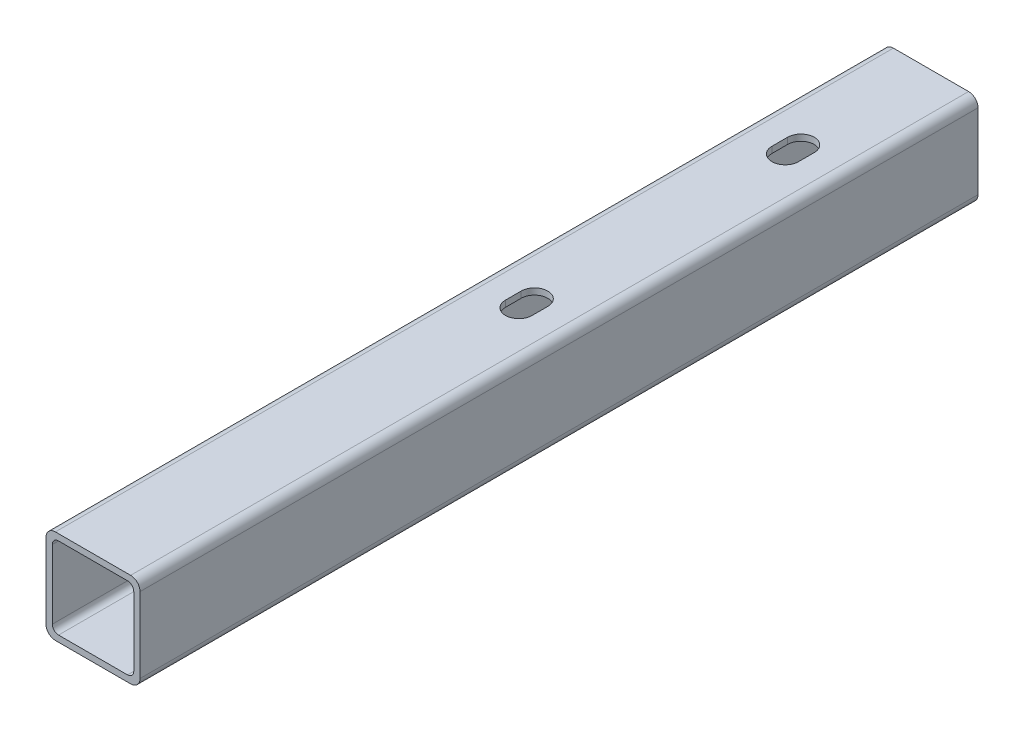
ISO-10303-21;
HEADER;
FILE_DESCRIPTION(('STEP AP214'),'2;1');
FILE_NAME('part.step','',(''),(''),'','','');
FILE_SCHEMA(('AUTOMOTIVE_DESIGN { 1 0 10303 214 1 1 1 1 }'));
ENDSEC;
DATA;
#1=APPLICATION_CONTEXT('core data for automotive mechanical design processes');
#2=APPLICATION_PROTOCOL_DEFINITION('international standard','automotive_design',2000,#1);
#3=PRODUCT_CONTEXT('',#1,'mechanical');
#4=PRODUCT('Part','Part','',(#3));
#5=PRODUCT_RELATED_PRODUCT_CATEGORY('part','',(#4));
#6=PRODUCT_DEFINITION_FORMATION('','',#4);
#7=PRODUCT_DEFINITION_CONTEXT('part definition',#1,'design');
#8=PRODUCT_DEFINITION('design','',#6,#7);
#9=PRODUCT_DEFINITION_SHAPE('','',#8);
#10=(LENGTH_UNIT() NAMED_UNIT(*) SI_UNIT(.MILLI.,.METRE.));
#11=(NAMED_UNIT(*) PLANE_ANGLE_UNIT() SI_UNIT($,.RADIAN.));
#12=(NAMED_UNIT(*) SI_UNIT($,.STERADIAN.) SOLID_ANGLE_UNIT());
#13=UNCERTAINTY_MEASURE_WITH_UNIT(LENGTH_MEASURE(1.E-05),#10,'distance_accuracy_value','');
#14=(GEOMETRIC_REPRESENTATION_CONTEXT(3) GLOBAL_UNCERTAINTY_ASSIGNED_CONTEXT((#13)) GLOBAL_UNIT_ASSIGNED_CONTEXT((#10,
#11,#12)) REPRESENTATION_CONTEXT('',''));
#15=CARTESIAN_POINT('',(0.,0.,0.));
#16=DIRECTION('',(0.,0.,1.));
#17=DIRECTION('',(1.,0.,0.));
#18=AXIS2_PLACEMENT_3D('',#15,#16,#17);
#19=CARTESIAN_POINT('',(3.00000000000003,-30.,-344.762716319083));
#20=DIRECTION('',(0.,-1.,0.));
#21=DIRECTION('',(1.,0.,0.));
#22=AXIS2_PLACEMENT_3D('',#19,#20,#21);
#23=PLANE('',#22);
#24=CARTESIAN_POINT('',(15.,-30.,-140.83630944789));
#25=DIRECTION('',(0.,-1.,0.));
#26=DIRECTION('',(1.,0.,0.));
#27=AXIS2_PLACEMENT_3D('',#24,#25,#26);
#28=CIRCLE('',#27,10.);
#29=CARTESIAN_POINT('',(4.99999999999999,-30.,-140.83630944789));
#30=VERTEX_POINT('',#29);
#31=CARTESIAN_POINT('',(25.,-30.,-140.83630944789));
#32=VERTEX_POINT('',#31);
#33=EDGE_CURVE('E49',#30,#32,#28,.T.);
#34=ORIENTED_EDGE('',*,*,#33,.F.);
#35=DIRECTION('',(0.,0.,-1.));
#36=VECTOR('',#35,1.);
#37=CARTESIAN_POINT('',(4.99999999999999,-30.,-140.83630944789));
#38=LINE('',#37,#36);
#39=CARTESIAN_POINT('',(4.99999999999999,-30.,-135.83630944789));
#40=VERTEX_POINT('',#39);
#41=EDGE_CURVE('E266',#40,#30,#38,.T.);
#42=ORIENTED_EDGE('',*,*,#41,.F.);
#43=CARTESIAN_POINT('',(15.,-30.,-135.83630944789));
#44=DIRECTION('',(0.,-1.,0.));
#45=DIRECTION('',(1.,0.,0.));
#46=AXIS2_PLACEMENT_3D('',#43,#44,#45);
#47=CIRCLE('',#46,10.);
#48=CARTESIAN_POINT('',(25.,-30.,-135.83630944789));
#49=VERTEX_POINT('',#48);
#50=EDGE_CURVE('E250',#49,#40,#47,.T.);
#51=ORIENTED_EDGE('',*,*,#50,.F.);
#52=DIRECTION('',(0.,0.,1.));
#53=VECTOR('',#52,1.);
#54=CARTESIAN_POINT('',(25.,-30.,-140.83630944789));
#55=LINE('',#54,#53);
#56=EDGE_CURVE('E260',#32,#49,#55,.T.);
#57=ORIENTED_EDGE('',*,*,#56,.F.);
#58=EDGE_LOOP('',(#34,#42,#51,#57));
#59=FACE_BOUND('',#58,.T.);
#60=CARTESIAN_POINT('',(15.,-30.,-225.83630944789));
#61=DIRECTION('',(0.,-1.,0.));
#62=DIRECTION('',(1.,0.,0.));
#63=AXIS2_PLACEMENT_3D('',#60,#61,#62);
#64=CIRCLE('',#63,9.99999999999999);
#65=CARTESIAN_POINT('',(5.,-30.,-225.83630944789));
#66=VERTEX_POINT('',#65);
#67=CARTESIAN_POINT('',(25.,-30.,-225.83630944789));
#68=VERTEX_POINT('',#67);
#69=EDGE_CURVE('E57',#66,#68,#64,.T.);
#70=ORIENTED_EDGE('',*,*,#69,.F.);
#71=DIRECTION('',(0.,0.,-1.));
#72=VECTOR('',#71,1.);
#73=CARTESIAN_POINT('',(5.,-30.,-225.83630944789));
#74=LINE('',#73,#72);
#75=CARTESIAN_POINT('',(5.,-30.,-220.83630944789));
#76=VERTEX_POINT('',#75);
#77=EDGE_CURVE('E283',#76,#66,#74,.T.);
#78=ORIENTED_EDGE('',*,*,#77,.F.);
#79=CARTESIAN_POINT('',(15.,-30.,-220.83630944789));
#80=DIRECTION('',(0.,-1.,0.));
#81=DIRECTION('',(1.,0.,0.));
#82=AXIS2_PLACEMENT_3D('',#79,#80,#81);
#83=CIRCLE('',#82,9.99999999999999);
#84=CARTESIAN_POINT('',(25.,-30.,-220.83630944789));
#85=VERTEX_POINT('',#84);
#86=EDGE_CURVE('E280',#85,#76,#83,.T.);
#87=ORIENTED_EDGE('',*,*,#86,.F.);
#88=DIRECTION('',(0.,0.,1.));
#89=VECTOR('',#88,1.);
#90=CARTESIAN_POINT('',(25.,-30.,-225.83630944789));
#91=LINE('',#90,#89);
#92=EDGE_CURVE('E277',#68,#85,#91,.T.);
#93=ORIENTED_EDGE('',*,*,#92,.F.);
#94=EDGE_LOOP('',(#70,#78,#87,#93));
#95=FACE_BOUND('',#94,.T.);
#96=DIRECTION('',(-1.,0.,0.));
#97=VECTOR('',#96,1.);
#98=CARTESIAN_POINT('',(3.00000000000003,-30.,-267.33630944789));
#99=LINE('',#98,#97);
#100=CARTESIAN_POINT('',(27.,-30.,-267.33630944789));
#101=VERTEX_POINT('',#100);
#102=CARTESIAN_POINT('',(3.00000000000003,-30.,-267.33630944789));
#103=VERTEX_POINT('',#102);
#104=EDGE_CURVE('E343',#101,#103,#99,.T.);
#105=ORIENTED_EDGE('',*,*,#104,.F.);
#106=DIRECTION('',(0.,0.,1.));
#107=VECTOR('',#106,1.);
#108=CARTESIAN_POINT('',(27.,-30.,-344.762716319083));
#109=LINE('',#108,#107);
#110=CARTESIAN_POINT('',(27.,-30.,0.));
#111=VERTEX_POINT('',#110);
#112=EDGE_CURVE('E455',#101,#111,#109,.T.);
#113=ORIENTED_EDGE('',*,*,#112,.T.);
#114=DIRECTION('',(1.,0.,0.));
#115=VECTOR('',#114,1.);
#116=CARTESIAN_POINT('',(3.00000000000003,-30.,0.));
#117=LINE('',#116,#115);
#118=CARTESIAN_POINT('',(3.00000000000003,-30.,0.));
#119=VERTEX_POINT('',#118);
#120=EDGE_CURVE('E421',#119,#111,#117,.T.);
#121=ORIENTED_EDGE('',*,*,#120,.F.);
#122=DIRECTION('',(0.,0.,1.));
#123=VECTOR('',#122,1.);
#124=CARTESIAN_POINT('',(3.00000000000003,-30.,-344.762716319083));
#125=LINE('',#124,#123);
#126=EDGE_CURVE('E442',#103,#119,#125,.T.);
#127=ORIENTED_EDGE('',*,*,#126,.F.);
#128=EDGE_LOOP('',(#105,#113,#121,#127));
#129=FACE_BOUND('',#128,.T.);
#130=ADVANCED_FACE('F34',(#59,#95,#129),#23,.T.);
#131=CARTESIAN_POINT('',(27.,-27.,-344.762716319083));
#132=DIRECTION('',(0.,0.,1.));
#133=DIRECTION('',(1.,0.,0.));
#134=AXIS2_PLACEMENT_3D('',#131,#132,#133);
#135=CYLINDRICAL_SURFACE('',#134,3.);
#136=CARTESIAN_POINT('',(27.,-27.,-267.33630944789));
#137=DIRECTION('',(0.,0.,1.));
#138=DIRECTION('',(0.,-1.,0.));
#139=AXIS2_PLACEMENT_3D('',#136,#137,#138);
#140=CIRCLE('',#139,3.);
#141=CARTESIAN_POINT('',(30.,-27.,-267.33630944789));
#142=VERTEX_POINT('',#141);
#143=EDGE_CURVE('E365',#142,#101,#140,.F.);
#144=ORIENTED_EDGE('',*,*,#143,.F.);
#145=DIRECTION('',(0.,0.,1.));
#146=VECTOR('',#145,1.);
#147=CARTESIAN_POINT('',(30.,-27.,-344.762716319083));
#148=LINE('',#147,#146);
#149=CARTESIAN_POINT('',(30.,-27.,0.));
#150=VERTEX_POINT('',#149);
#151=EDGE_CURVE('E453',#142,#150,#148,.T.);
#152=ORIENTED_EDGE('',*,*,#151,.T.);
#153=CARTESIAN_POINT('',(27.,-27.,0.));
#154=DIRECTION('',(0.,0.,1.));
#155=DIRECTION('',(1.,0.,0.));
#156=AXIS2_PLACEMENT_3D('',#153,#154,#155);
#157=CIRCLE('',#156,3.);
#158=EDGE_CURVE('E424',#111,#150,#157,.T.);
#159=ORIENTED_EDGE('',*,*,#158,.F.);
#160=ORIENTED_EDGE('',*,*,#112,.F.);
#161=EDGE_LOOP('',(#144,#152,#159,#160));
#162=FACE_BOUND('',#161,.T.);
#163=ADVANCED_FACE('F519',(#162),#135,.T.);
#164=CARTESIAN_POINT('',(30.,-3.,-344.762716319083));
#165=DIRECTION('',(1.,0.,0.));
#166=DIRECTION('',(0.,1.,0.));
#167=AXIS2_PLACEMENT_3D('',#164,#165,#166);
#168=PLANE('',#167);
#169=DIRECTION('',(0.,-1.,0.));
#170=VECTOR('',#169,1.);
#171=CARTESIAN_POINT('',(30.,-3.,-267.33630944789));
#172=LINE('',#171,#170);
#173=CARTESIAN_POINT('',(30.,-3.,-267.33630944789));
#174=VERTEX_POINT('',#173);
#175=EDGE_CURVE('E367',#174,#142,#172,.T.);
#176=ORIENTED_EDGE('',*,*,#175,.F.);
#177=DIRECTION('',(0.,0.,1.));
#178=VECTOR('',#177,1.);
#179=CARTESIAN_POINT('',(30.,-3.,-344.762716319083));
#180=LINE('',#179,#178);
#181=CARTESIAN_POINT('',(30.,-3.,0.));
#182=VERTEX_POINT('',#181);
#183=EDGE_CURVE('E451',#174,#182,#180,.T.);
#184=ORIENTED_EDGE('',*,*,#183,.T.);
#185=DIRECTION('',(0.,1.,0.));
#186=VECTOR('',#185,1.);
#187=CARTESIAN_POINT('',(30.,-3.,0.));
#188=LINE('',#187,#186);
#189=EDGE_CURVE('E427',#150,#182,#188,.T.);
#190=ORIENTED_EDGE('',*,*,#189,.F.);
#191=ORIENTED_EDGE('',*,*,#151,.F.);
#192=EDGE_LOOP('',(#176,#184,#190,#191));
#193=FACE_BOUND('',#192,.T.);
#194=ADVANCED_FACE('F523',(#193),#168,.T.);
#195=CARTESIAN_POINT('',(27.,-3.,-344.762716319083));
#196=DIRECTION('',(0.,0.,1.));
#197=DIRECTION('',(1.,0.,0.));
#198=AXIS2_PLACEMENT_3D('',#195,#196,#197);
#199=CYLINDRICAL_SURFACE('',#198,3.);
#200=CARTESIAN_POINT('',(27.,-3.,-267.33630944789));
#201=DIRECTION('',(0.,0.,1.));
#202=DIRECTION('',(0.,-1.,0.));
#203=AXIS2_PLACEMENT_3D('',#200,#201,#202);
#204=CIRCLE('',#203,3.);
#205=CARTESIAN_POINT('',(27.,0.,-267.33630944789));
#206=VERTEX_POINT('',#205);
#207=EDGE_CURVE('E370',#206,#174,#204,.F.);
#208=ORIENTED_EDGE('',*,*,#207,.F.);
#209=DIRECTION('',(0.,0.,1.));
#210=VECTOR('',#209,1.);
#211=CARTESIAN_POINT('',(27.,0.,-344.762716319083));
#212=LINE('',#211,#210);
#213=CARTESIAN_POINT('',(27.,0.,0.));
#214=VERTEX_POINT('',#213);
#215=EDGE_CURVE('E449',#206,#214,#212,.T.);
#216=ORIENTED_EDGE('',*,*,#215,.T.);
#217=CARTESIAN_POINT('',(27.,-3.,0.));
#218=DIRECTION('',(0.,0.,1.));
#219=DIRECTION('',(-1.,0.,0.));
#220=AXIS2_PLACEMENT_3D('',#217,#218,#219);
#221=CIRCLE('',#220,3.);
#222=EDGE_CURVE('E430',#182,#214,#221,.T.);
#223=ORIENTED_EDGE('',*,*,#222,.F.);
#224=ORIENTED_EDGE('',*,*,#183,.F.);
#225=EDGE_LOOP('',(#208,#216,#223,#224));
#226=FACE_BOUND('',#225,.T.);
#227=ADVANCED_FACE('F529',(#226),#199,.T.);
#228=CARTESIAN_POINT('',(3.00000000000005,0.,-344.762716319083));
#229=DIRECTION('',(0.,1.,0.));
#230=DIRECTION('',(0.,0.,1.));
#231=AXIS2_PLACEMENT_3D('',#228,#229,#230);
#232=PLANE('',#231);
#233=CARTESIAN_POINT('',(15.,0.,-135.83630944789));
#234=DIRECTION('',(0.,-1.,0.));
#235=DIRECTION('',(1.,0.,0.));
#236=AXIS2_PLACEMENT_3D('',#233,#234,#235);
#237=CIRCLE('',#236,4.25000000000001);
#238=CARTESIAN_POINT('',(19.25,0.,-135.83630944789));
#239=VERTEX_POINT('',#238);
#240=CARTESIAN_POINT('',(10.75,0.,-135.83630944789));
#241=VERTEX_POINT('',#240);
#242=EDGE_CURVE('E294',#239,#241,#237,.T.);
#243=ORIENTED_EDGE('',*,*,#242,.T.);
#244=DIRECTION('',(0.,0.,-1.));
#245=VECTOR('',#244,1.);
#246=CARTESIAN_POINT('',(10.75,0.,-135.83630944789));
#247=LINE('',#246,#245);
#248=CARTESIAN_POINT('',(10.75,0.,-140.83630944789));
#249=VERTEX_POINT('',#248);
#250=EDGE_CURVE('E297',#241,#249,#247,.T.);
#251=ORIENTED_EDGE('',*,*,#250,.T.);
#252=CARTESIAN_POINT('',(15.,0.,-140.83630944789));
#253=DIRECTION('',(0.,-1.,0.));
#254=DIRECTION('',(1.,0.,0.));
#255=AXIS2_PLACEMENT_3D('',#252,#253,#254);
#256=CIRCLE('',#255,4.25000000000001);
#257=CARTESIAN_POINT('',(19.25,0.,-140.83630944789));
#258=VERTEX_POINT('',#257);
#259=EDGE_CURVE('E301',#249,#258,#256,.T.);
#260=ORIENTED_EDGE('',*,*,#259,.T.);
#261=DIRECTION('',(0.,0.,1.));
#262=VECTOR('',#261,1.);
#263=CARTESIAN_POINT('',(19.25,0.,-135.83630944789));
#264=LINE('',#263,#262);
#265=EDGE_CURVE('E304',#258,#239,#264,.T.);
#266=ORIENTED_EDGE('',*,*,#265,.T.);
#267=EDGE_LOOP('',(#243,#251,#260,#266));
#268=FACE_BOUND('',#267,.T.);
#269=CARTESIAN_POINT('',(15.,0.,-225.83630944789));
#270=DIRECTION('',(0.,-1.,0.));
#271=DIRECTION('',(1.,0.,0.));
#272=AXIS2_PLACEMENT_3D('',#269,#270,#271);
#273=CIRCLE('',#272,4.25000000000001);
#274=CARTESIAN_POINT('',(10.75,0.,-225.83630944789));
#275=VERTEX_POINT('',#274);
#276=CARTESIAN_POINT('',(19.25,0.,-225.83630944789));
#277=VERTEX_POINT('',#276);
#278=EDGE_CURVE('E273',#275,#277,#273,.T.);
#279=ORIENTED_EDGE('',*,*,#278,.T.);
#280=DIRECTION('',(0.,0.,1.));
#281=VECTOR('',#280,1.);
#282=CARTESIAN_POINT('',(19.25,0.,-225.83630944789));
#283=LINE('',#282,#281);
#284=CARTESIAN_POINT('',(19.25,0.,-220.83630944789));
#285=VERTEX_POINT('',#284);
#286=EDGE_CURVE('E321',#277,#285,#283,.T.);
#287=ORIENTED_EDGE('',*,*,#286,.T.);
#288=CARTESIAN_POINT('',(15.,0.,-220.83630944789));
#289=DIRECTION('',(0.,-1.,0.));
#290=DIRECTION('',(1.,0.,0.));
#291=AXIS2_PLACEMENT_3D('',#288,#289,#290);
#292=CIRCLE('',#291,4.25000000000001);
#293=CARTESIAN_POINT('',(10.75,0.,-220.83630944789));
#294=VERTEX_POINT('',#293);
#295=EDGE_CURVE('E324',#285,#294,#292,.T.);
#296=ORIENTED_EDGE('',*,*,#295,.T.);
#297=DIRECTION('',(0.,0.,-1.));
#298=VECTOR('',#297,1.);
#299=CARTESIAN_POINT('',(10.75,0.,-225.83630944789));
#300=LINE('',#299,#298);
#301=EDGE_CURVE('E327',#294,#275,#300,.T.);
#302=ORIENTED_EDGE('',*,*,#301,.T.);
#303=EDGE_LOOP('',(#279,#287,#296,#302));
#304=FACE_BOUND('',#303,.T.);
#305=DIRECTION('',(1.,0.,0.));
#306=VECTOR('',#305,1.);
#307=CARTESIAN_POINT('',(3.00000000000005,0.,-267.33630944789));
#308=LINE('',#307,#306);
#309=CARTESIAN_POINT('',(3.00000000000005,0.,-267.33630944789));
#310=VERTEX_POINT('',#309);
#311=EDGE_CURVE('E372',#310,#206,#308,.T.);
#312=ORIENTED_EDGE('',*,*,#311,.F.);
#313=DIRECTION('',(0.,0.,1.));
#314=VECTOR('',#313,1.);
#315=CARTESIAN_POINT('',(3.00000000000005,0.,-344.762716319083));
#316=LINE('',#315,#314);
#317=CARTESIAN_POINT('',(3.00000000000005,0.,0.));
#318=VERTEX_POINT('',#317);
#319=EDGE_CURVE('E447',#310,#318,#316,.T.);
#320=ORIENTED_EDGE('',*,*,#319,.T.);
#321=DIRECTION('',(-1.,0.,0.));
#322=VECTOR('',#321,1.);
#323=CARTESIAN_POINT('',(3.00000000000005,0.,0.));
#324=LINE('',#323,#322);
#325=EDGE_CURVE('E433',#214,#318,#324,.T.);
#326=ORIENTED_EDGE('',*,*,#325,.F.);
#327=ORIENTED_EDGE('',*,*,#215,.F.);
#328=EDGE_LOOP('',(#312,#320,#326,#327));
#329=FACE_BOUND('',#328,.T.);
#330=ADVANCED_FACE('F533',(#268,#304,#329),#232,.T.);
#331=CARTESIAN_POINT('',(3.00000000000002,-3.,-344.762716319083));
#332=DIRECTION('',(0.,0.,1.));
#333=DIRECTION('',(1.,0.,0.));
#334=AXIS2_PLACEMENT_3D('',#331,#332,#333);
#335=CYLINDRICAL_SURFACE('',#334,3.);
#336=CARTESIAN_POINT('',(3.00000000000002,-3.,-267.33630944789));
#337=DIRECTION('',(0.,0.,1.));
#338=DIRECTION('',(0.,-1.,0.));
#339=AXIS2_PLACEMENT_3D('',#336,#337,#338);
#340=CIRCLE('',#339,3.);
#341=CARTESIAN_POINT('',(0.,-3.00000000000002,-267.33630944789));
#342=VERTEX_POINT('',#341);
#343=EDGE_CURVE('E374',#342,#310,#340,.F.);
#344=ORIENTED_EDGE('',*,*,#343,.F.);
#345=DIRECTION('',(0.,0.,1.));
#346=VECTOR('',#345,1.);
#347=CARTESIAN_POINT('',(0.,-3.00000000000002,-344.762716319083));
#348=LINE('',#347,#346);
#349=CARTESIAN_POINT('',(0.,-3.00000000000002,0.));
#350=VERTEX_POINT('',#349);
#351=EDGE_CURVE('E445',#342,#350,#348,.T.);
#352=ORIENTED_EDGE('',*,*,#351,.T.);
#353=CARTESIAN_POINT('',(3.00000000000002,-3.,0.));
#354=DIRECTION('',(0.,0.,1.));
#355=DIRECTION('',(1.,0.,0.));
#356=AXIS2_PLACEMENT_3D('',#353,#354,#355);
#357=CIRCLE('',#356,3.);
#358=EDGE_CURVE('E436',#318,#350,#357,.T.);
#359=ORIENTED_EDGE('',*,*,#358,.F.);
#360=ORIENTED_EDGE('',*,*,#319,.F.);
#361=EDGE_LOOP('',(#344,#352,#359,#360));
#362=FACE_BOUND('',#361,.T.);
#363=ADVANCED_FACE('F537',(#362),#335,.T.);
#364=CARTESIAN_POINT('',(0.,-3.00000000000002,-344.762716319083));
#365=DIRECTION('',(-1.,0.,0.));
#366=DIRECTION('',(0.,0.,1.));
#367=AXIS2_PLACEMENT_3D('',#364,#365,#366);
#368=PLANE('',#367);
#369=DIRECTION('',(0.,1.,0.));
#370=VECTOR('',#369,1.);
#371=CARTESIAN_POINT('',(0.,-3.00000000000002,-267.33630944789));
#372=LINE('',#371,#370);
#373=CARTESIAN_POINT('',(0.,-27.,-267.33630944789));
#374=VERTEX_POINT('',#373);
#375=EDGE_CURVE('E376',#374,#342,#372,.T.);
#376=ORIENTED_EDGE('',*,*,#375,.F.);
#377=DIRECTION('',(0.,0.,1.));
#378=VECTOR('',#377,1.);
#379=CARTESIAN_POINT('',(0.,-27.,-344.762716319083));
#380=LINE('',#379,#378);
#381=CARTESIAN_POINT('',(0.,-27.,0.));
#382=VERTEX_POINT('',#381);
#383=EDGE_CURVE('E443',#374,#382,#380,.T.);
#384=ORIENTED_EDGE('',*,*,#383,.T.);
#385=DIRECTION('',(0.,-1.,0.));
#386=VECTOR('',#385,1.);
#387=CARTESIAN_POINT('',(0.,-3.00000000000002,0.));
#388=LINE('',#387,#386);
#389=EDGE_CURVE('E439',#350,#382,#388,.T.);
#390=ORIENTED_EDGE('',*,*,#389,.F.);
#391=ORIENTED_EDGE('',*,*,#351,.F.);
#392=EDGE_LOOP('',(#376,#384,#390,#391));
#393=FACE_BOUND('',#392,.T.);
#394=ADVANCED_FACE('F541',(#393),#368,.T.);
#395=CARTESIAN_POINT('',(3.00000000000003,-27.,-344.762716319083));
#396=DIRECTION('',(0.,0.,1.));
#397=DIRECTION('',(1.,0.,0.));
#398=AXIS2_PLACEMENT_3D('',#395,#396,#397);
#399=CYLINDRICAL_SURFACE('',#398,3.);
#400=CARTESIAN_POINT('',(3.00000000000003,-27.,-267.33630944789));
#401=DIRECTION('',(0.,0.,1.));
#402=DIRECTION('',(0.,-1.,0.));
#403=AXIS2_PLACEMENT_3D('',#400,#401,#402);
#404=CIRCLE('',#403,3.);
#405=EDGE_CURVE('E362',#103,#374,#404,.F.);
#406=ORIENTED_EDGE('',*,*,#405,.F.);
#407=ORIENTED_EDGE('',*,*,#126,.T.);
#408=CARTESIAN_POINT('',(3.00000000000003,-27.,0.));
#409=DIRECTION('',(0.,0.,1.));
#410=DIRECTION('',(1.,0.,0.));
#411=AXIS2_PLACEMENT_3D('',#408,#409,#410);
#412=CIRCLE('',#411,3.);
#413=EDGE_CURVE('E405',#382,#119,#412,.T.);
#414=ORIENTED_EDGE('',*,*,#413,.F.);
#415=ORIENTED_EDGE('',*,*,#383,.F.);
#416=EDGE_LOOP('',(#406,#407,#414,#415));
#417=FACE_BOUND('',#416,.T.);
#418=ADVANCED_FACE('F36',(#417),#399,.T.);
#419=CARTESIAN_POINT('',(3.00000000000003,-27.,0.));
#420=DIRECTION('',(0.,0.,1.));
#421=DIRECTION('',(1.,0.,0.));
#422=AXIS2_PLACEMENT_3D('',#419,#420,#421);
#423=PLANE('',#422);
#424=CARTESIAN_POINT('',(4.00000000000003,-26.,0.));
#425=DIRECTION('',(0.,0.,1.));
#426=DIRECTION('',(1.,0.,0.));
#427=AXIS2_PLACEMENT_3D('',#424,#425,#426);
#428=CIRCLE('',#427,2.);
#429=CARTESIAN_POINT('',(2.00000000000003,-26.,0.));
#430=VERTEX_POINT('',#429);
#431=CARTESIAN_POINT('',(4.00000000000004,-28.,0.));
#432=VERTEX_POINT('',#431);
#433=EDGE_CURVE('E311',#430,#432,#428,.T.);
#434=ORIENTED_EDGE('',*,*,#433,.F.);
#435=DIRECTION('',(0.,-1.,0.));
#436=VECTOR('',#435,1.);
#437=CARTESIAN_POINT('',(2.00000000000003,-4.00000000000001,0.));
#438=LINE('',#437,#436);
#439=CARTESIAN_POINT('',(2.00000000000003,-4.00000000000001,0.));
#440=VERTEX_POINT('',#439);
#441=EDGE_CURVE('E399',#440,#430,#438,.T.);
#442=ORIENTED_EDGE('',*,*,#441,.F.);
#443=CARTESIAN_POINT('',(4.00000000000003,-4.,0.));
#444=DIRECTION('',(0.,0.,1.));
#445=DIRECTION('',(1.,0.,0.));
#446=AXIS2_PLACEMENT_3D('',#443,#444,#445);
#447=CIRCLE('',#446,2.);
#448=CARTESIAN_POINT('',(4.00000000000004,-2.,0.));
#449=VERTEX_POINT('',#448);
#450=EDGE_CURVE('E396',#449,#440,#447,.T.);
#451=ORIENTED_EDGE('',*,*,#450,.F.);
#452=DIRECTION('',(-1.,0.,0.));
#453=VECTOR('',#452,1.);
#454=CARTESIAN_POINT('',(4.00000000000004,-2.,0.));
#455=LINE('',#454,#453);
#456=CARTESIAN_POINT('',(26.,-2.,0.));
#457=VERTEX_POINT('',#456);
#458=EDGE_CURVE('E393',#457,#449,#455,.T.);
#459=ORIENTED_EDGE('',*,*,#458,.F.);
#460=CARTESIAN_POINT('',(26.,-4.,0.));
#461=DIRECTION('',(0.,0.,1.));
#462=DIRECTION('',(-1.,0.,0.));
#463=AXIS2_PLACEMENT_3D('',#460,#461,#462);
#464=CIRCLE('',#463,2.);
#465=CARTESIAN_POINT('',(28.,-4.00000000000001,0.));
#466=VERTEX_POINT('',#465);
#467=EDGE_CURVE('E390',#466,#457,#464,.T.);
#468=ORIENTED_EDGE('',*,*,#467,.F.);
#469=DIRECTION('',(0.,1.,0.));
#470=VECTOR('',#469,1.);
#471=CARTESIAN_POINT('',(28.,-4.00000000000001,0.));
#472=LINE('',#471,#470);
#473=CARTESIAN_POINT('',(28.,-26.,0.));
#474=VERTEX_POINT('',#473);
#475=EDGE_CURVE('E387',#474,#466,#472,.T.);
#476=ORIENTED_EDGE('',*,*,#475,.F.);
#477=CARTESIAN_POINT('',(26.,-26.,0.));
#478=DIRECTION('',(0.,0.,1.));
#479=DIRECTION('',(1.,0.,0.));
#480=AXIS2_PLACEMENT_3D('',#477,#478,#479);
#481=CIRCLE('',#480,2.);
#482=CARTESIAN_POINT('',(26.,-28.,0.));
#483=VERTEX_POINT('',#482);
#484=EDGE_CURVE('E384',#483,#474,#481,.T.);
#485=ORIENTED_EDGE('',*,*,#484,.F.);
#486=DIRECTION('',(1.,0.,0.));
#487=VECTOR('',#486,1.);
#488=CARTESIAN_POINT('',(4.00000000000004,-28.,0.));
#489=LINE('',#488,#487);
#490=EDGE_CURVE('E381',#432,#483,#489,.T.);
#491=ORIENTED_EDGE('',*,*,#490,.F.);
#492=EDGE_LOOP('',(#434,#442,#451,#459,#468,#476,#485,#491));
#493=FACE_BOUND('',#492,.T.);
#494=ORIENTED_EDGE('',*,*,#413,.T.);
#495=ORIENTED_EDGE('',*,*,#120,.T.);
#496=ORIENTED_EDGE('',*,*,#158,.T.);
#497=ORIENTED_EDGE('',*,*,#189,.T.);
#498=ORIENTED_EDGE('',*,*,#222,.T.);
#499=ORIENTED_EDGE('',*,*,#325,.T.);
#500=ORIENTED_EDGE('',*,*,#358,.T.);
#501=ORIENTED_EDGE('',*,*,#389,.T.);
#502=EDGE_LOOP('',(#494,#495,#496,#497,#498,#499,#500,#501));
#503=FACE_BOUND('',#502,.T.);
#504=ADVANCED_FACE('F546',(#493,#503),#423,.T.);
#505=CARTESIAN_POINT('',(4.00000000000004,-28.,-344.762716319083));
#506=DIRECTION('',(0.,-1.,0.));
#507=DIRECTION('',(0.,0.,-1.));
#508=AXIS2_PLACEMENT_3D('',#505,#506,#507);
#509=PLANE('',#508);
#510=DIRECTION('',(0.,0.,-1.));
#511=VECTOR('',#510,1.);
#512=CARTESIAN_POINT('',(5.00000000000002,-28.,-344.762716319083));
#513=LINE('',#512,#511);
#514=CARTESIAN_POINT('',(4.99999999999999,-28.,-135.83630944789));
#515=VERTEX_POINT('',#514);
#516=CARTESIAN_POINT('',(4.99999999999999,-28.,-140.83630944789));
#517=VERTEX_POINT('',#516);
#518=EDGE_CURVE('E42',#515,#517,#513,.T.);
#519=ORIENTED_EDGE('',*,*,#518,.T.);
#520=CARTESIAN_POINT('',(15.,-28.,-140.83630944789));
#521=DIRECTION('',(0.,-1.,0.));
#522=DIRECTION('',(0.,0.,-1.));
#523=AXIS2_PLACEMENT_3D('',#520,#521,#522);
#524=CIRCLE('',#523,10.);
#525=CARTESIAN_POINT('',(25.,-28.,-140.83630944789));
#526=VERTEX_POINT('',#525);
#527=EDGE_CURVE('E11',#517,#526,#524,.T.);
#528=ORIENTED_EDGE('',*,*,#527,.T.);
#529=DIRECTION('',(0.,0.,1.));
#530=VECTOR('',#529,1.);
#531=CARTESIAN_POINT('',(25.,-28.,-344.762716319083));
#532=LINE('',#531,#530);
#533=CARTESIAN_POINT('',(25.,-28.,-135.83630944789));
#534=VERTEX_POINT('',#533);
#535=EDGE_CURVE('E495',#526,#534,#532,.T.);
#536=ORIENTED_EDGE('',*,*,#535,.T.);
#537=CARTESIAN_POINT('',(15.,-28.,-135.83630944789));
#538=DIRECTION('',(0.,-1.,0.));
#539=DIRECTION('',(0.,0.,-1.));
#540=AXIS2_PLACEMENT_3D('',#537,#538,#539);
#541=CIRCLE('',#540,10.);
#542=EDGE_CURVE('E253',#534,#515,#541,.T.);
#543=ORIENTED_EDGE('',*,*,#542,.T.);
#544=EDGE_LOOP('',(#519,#528,#536,#543));
#545=FACE_BOUND('',#544,.T.);
#546=DIRECTION('',(0.,0.,-1.));
#547=VECTOR('',#546,1.);
#548=CARTESIAN_POINT('',(5.00000000000002,-28.,-344.762716319083));
#549=LINE('',#548,#547);
#550=CARTESIAN_POINT('',(5.,-28.,-220.83630944789));
#551=VERTEX_POINT('',#550);
#552=CARTESIAN_POINT('',(5.,-28.,-225.83630944789));
#553=VERTEX_POINT('',#552);
#554=EDGE_CURVE('E489',#551,#553,#549,.T.);
#555=ORIENTED_EDGE('',*,*,#554,.T.);
#556=CARTESIAN_POINT('',(15.,-28.,-225.83630944789));
#557=DIRECTION('',(0.,-1.,0.));
#558=DIRECTION('',(0.,0.,-1.));
#559=AXIS2_PLACEMENT_3D('',#556,#557,#558);
#560=CIRCLE('',#559,9.99999999999999);
#561=CARTESIAN_POINT('',(25.,-28.,-225.83630944789));
#562=VERTEX_POINT('',#561);
#563=EDGE_CURVE('E492',#553,#562,#560,.T.);
#564=ORIENTED_EDGE('',*,*,#563,.T.);
#565=DIRECTION('',(0.,0.,1.));
#566=VECTOR('',#565,1.);
#567=CARTESIAN_POINT('',(25.,-28.,-344.762716319083));
#568=LINE('',#567,#566);
#569=CARTESIAN_POINT('',(25.,-28.,-220.83630944789));
#570=VERTEX_POINT('',#569);
#571=EDGE_CURVE('E483',#562,#570,#568,.T.);
#572=ORIENTED_EDGE('',*,*,#571,.T.);
#573=CARTESIAN_POINT('',(15.,-28.,-220.83630944789));
#574=DIRECTION('',(0.,-1.,0.));
#575=DIRECTION('',(0.,0.,-1.));
#576=AXIS2_PLACEMENT_3D('',#573,#574,#575);
#577=CIRCLE('',#576,9.99999999999999);
#578=EDGE_CURVE('E486',#570,#551,#577,.T.);
#579=ORIENTED_EDGE('',*,*,#578,.T.);
#580=EDGE_LOOP('',(#555,#564,#572,#579));
#581=FACE_BOUND('',#580,.T.);
#582=DIRECTION('',(0.,0.,1.));
#583=VECTOR('',#582,1.);
#584=CARTESIAN_POINT('',(26.,-28.,-344.762716319083));
#585=LINE('',#584,#583);
#586=CARTESIAN_POINT('',(26.,-28.,-267.33630944789));
#587=VERTEX_POINT('',#586);
#588=EDGE_CURVE('E416',#587,#483,#585,.T.);
#589=ORIENTED_EDGE('',*,*,#588,.F.);
#590=DIRECTION('',(-1.,0.,0.));
#591=VECTOR('',#590,1.);
#592=CARTESIAN_POINT('',(4.00000000000004,-28.,-267.33630944789));
#593=LINE('',#592,#591);
#594=CARTESIAN_POINT('',(4.00000000000004,-28.,-267.33630944789));
#595=VERTEX_POINT('',#594);
#596=EDGE_CURVE('E368',#587,#595,#593,.T.);
#597=ORIENTED_EDGE('',*,*,#596,.T.);
#598=DIRECTION('',(0.,0.,1.));
#599=VECTOR('',#598,1.);
#600=CARTESIAN_POINT('',(4.00000000000004,-28.,-344.762716319083));
#601=LINE('',#600,#599);
#602=EDGE_CURVE('E402',#595,#432,#601,.T.);
#603=ORIENTED_EDGE('',*,*,#602,.T.);
#604=ORIENTED_EDGE('',*,*,#490,.T.);
#605=EDGE_LOOP('',(#589,#597,#603,#604));
#606=FACE_BOUND('',#605,.T.);
#607=ADVANCED_FACE('F499',(#545,#581,#606),#509,.F.);
#608=CARTESIAN_POINT('',(26.,-26.,-344.762716319083));
#609=DIRECTION('',(0.,0.,1.));
#610=DIRECTION('',(1.,0.,0.));
#611=AXIS2_PLACEMENT_3D('',#608,#609,#610);
#612=CYLINDRICAL_SURFACE('',#611,2.);
#613=DIRECTION('',(0.,0.,1.));
#614=VECTOR('',#613,1.);
#615=CARTESIAN_POINT('',(28.,-26.,-344.762716319083));
#616=LINE('',#615,#614);
#617=CARTESIAN_POINT('',(28.,-26.,-267.33630944789));
#618=VERTEX_POINT('',#617);
#619=EDGE_CURVE('E414',#618,#474,#616,.T.);
#620=ORIENTED_EDGE('',*,*,#619,.F.);
#621=CARTESIAN_POINT('',(26.,-26.,-267.33630944789));
#622=DIRECTION('',(0.,0.,1.));
#623=DIRECTION('',(0.,-1.,0.));
#624=AXIS2_PLACEMENT_3D('',#621,#622,#623);
#625=CIRCLE('',#624,2.);
#626=EDGE_CURVE('E340',#618,#587,#625,.F.);
#627=ORIENTED_EDGE('',*,*,#626,.T.);
#628=ORIENTED_EDGE('',*,*,#588,.T.);
#629=ORIENTED_EDGE('',*,*,#484,.T.);
#630=EDGE_LOOP('',(#620,#627,#628,#629));
#631=FACE_BOUND('',#630,.T.);
#632=ADVANCED_FACE('F558',(#631),#612,.F.);
#633=CARTESIAN_POINT('',(28.,-4.00000000000001,-344.762716319083));
#634=DIRECTION('',(1.,0.,0.));
#635=DIRECTION('',(0.,0.,-1.));
#636=AXIS2_PLACEMENT_3D('',#633,#634,#635);
#637=PLANE('',#636);
#638=DIRECTION('',(0.,0.,1.));
#639=VECTOR('',#638,1.);
#640=CARTESIAN_POINT('',(28.,-4.00000000000001,-344.762716319083));
#641=LINE('',#640,#639);
#642=CARTESIAN_POINT('',(28.,-4.00000000000001,-267.33630944789));
#643=VERTEX_POINT('',#642);
#644=EDGE_CURVE('E412',#643,#466,#641,.T.);
#645=ORIENTED_EDGE('',*,*,#644,.F.);
#646=DIRECTION('',(0.,-1.,0.));
#647=VECTOR('',#646,1.);
#648=CARTESIAN_POINT('',(28.,-4.00000000000001,-267.33630944789));
#649=LINE('',#648,#647);
#650=EDGE_CURVE('E344',#643,#618,#649,.T.);
#651=ORIENTED_EDGE('',*,*,#650,.T.);
#652=ORIENTED_EDGE('',*,*,#619,.T.);
#653=ORIENTED_EDGE('',*,*,#475,.T.);
#654=EDGE_LOOP('',(#645,#651,#652,#653));
#655=FACE_BOUND('',#654,.T.);
#656=ADVANCED_FACE('F561',(#655),#637,.F.);
#657=CARTESIAN_POINT('',(26.,-4.,-344.762716319083));
#658=DIRECTION('',(0.,0.,1.));
#659=DIRECTION('',(1.,0.,0.));
#660=AXIS2_PLACEMENT_3D('',#657,#658,#659);
#661=CYLINDRICAL_SURFACE('',#660,2.);
#662=DIRECTION('',(0.,0.,1.));
#663=VECTOR('',#662,1.);
#664=CARTESIAN_POINT('',(26.,-2.,-344.762716319083));
#665=LINE('',#664,#663);
#666=CARTESIAN_POINT('',(26.,-2.,-267.33630944789));
#667=VERTEX_POINT('',#666);
#668=EDGE_CURVE('E410',#667,#457,#665,.T.);
#669=ORIENTED_EDGE('',*,*,#668,.F.);
#670=CARTESIAN_POINT('',(26.,-4.,-267.33630944789));
#671=DIRECTION('',(0.,0.,1.));
#672=DIRECTION('',(0.,-1.,0.));
#673=AXIS2_PLACEMENT_3D('',#670,#671,#672);
#674=CIRCLE('',#673,2.);
#675=EDGE_CURVE('E347',#667,#643,#674,.F.);
#676=ORIENTED_EDGE('',*,*,#675,.T.);
#677=ORIENTED_EDGE('',*,*,#644,.T.);
#678=ORIENTED_EDGE('',*,*,#467,.T.);
#679=EDGE_LOOP('',(#669,#676,#677,#678));
#680=FACE_BOUND('',#679,.T.);
#681=ADVANCED_FACE('F565',(#680),#661,.F.);
#682=CARTESIAN_POINT('',(4.00000000000004,-2.,-344.762716319083));
#683=DIRECTION('',(0.,1.,0.));
#684=DIRECTION('',(0.,0.,1.));
#685=AXIS2_PLACEMENT_3D('',#682,#683,#684);
#686=PLANE('',#685);
#687=DIRECTION('',(0.,0.,1.));
#688=VECTOR('',#687,1.);
#689=CARTESIAN_POINT('',(10.7500000000001,-2.,-344.762716319083));
#690=LINE('',#689,#688);
#691=CARTESIAN_POINT('',(10.75,-2.,-140.83630944789));
#692=VERTEX_POINT('',#691);
#693=CARTESIAN_POINT('',(10.75,-2.,-135.83630944789));
#694=VERTEX_POINT('',#693);
#695=EDGE_CURVE('E471',#692,#694,#690,.T.);
#696=ORIENTED_EDGE('',*,*,#695,.T.);
#697=CARTESIAN_POINT('',(15.,-2.,-135.83630944789));
#698=DIRECTION('',(0.,1.,0.));
#699=DIRECTION('',(0.,0.,1.));
#700=AXIS2_PLACEMENT_3D('',#697,#698,#699);
#701=CIRCLE('',#700,4.25000000000001);
#702=CARTESIAN_POINT('',(19.25,-2.,-135.83630944789));
#703=VERTEX_POINT('',#702);
#704=EDGE_CURVE('E480',#694,#703,#701,.T.);
#705=ORIENTED_EDGE('',*,*,#704,.T.);
#706=DIRECTION('',(0.,0.,-1.));
#707=VECTOR('',#706,1.);
#708=CARTESIAN_POINT('',(19.25,-2.,-344.762716319083));
#709=LINE('',#708,#707);
#710=CARTESIAN_POINT('',(19.25,-2.,-140.83630944789));
#711=VERTEX_POINT('',#710);
#712=EDGE_CURVE('E477',#703,#711,#709,.T.);
#713=ORIENTED_EDGE('',*,*,#712,.T.);
#714=CARTESIAN_POINT('',(15.,-2.,-140.83630944789));
#715=DIRECTION('',(0.,1.,0.));
#716=DIRECTION('',(0.,0.,1.));
#717=AXIS2_PLACEMENT_3D('',#714,#715,#716);
#718=CIRCLE('',#717,4.25000000000001);
#719=EDGE_CURVE('E474',#711,#692,#718,.T.);
#720=ORIENTED_EDGE('',*,*,#719,.T.);
#721=EDGE_LOOP('',(#696,#705,#713,#720));
#722=FACE_BOUND('',#721,.T.);
#723=DIRECTION('',(0.,0.,-1.));
#724=VECTOR('',#723,1.);
#725=CARTESIAN_POINT('',(19.2500000000001,-2.,-344.762716319083));
#726=LINE('',#725,#724);
#727=CARTESIAN_POINT('',(19.25,-2.,-220.83630944789));
#728=VERTEX_POINT('',#727);
#729=CARTESIAN_POINT('',(19.25,-2.,-225.83630944789));
#730=VERTEX_POINT('',#729);
#731=EDGE_CURVE('E364',#728,#730,#726,.T.);
#732=ORIENTED_EDGE('',*,*,#731,.T.);
#733=CARTESIAN_POINT('',(15.,-2.,-225.83630944789));
#734=DIRECTION('',(0.,1.,0.));
#735=DIRECTION('',(0.,0.,1.));
#736=AXIS2_PLACEMENT_3D('',#733,#734,#735);
#737=CIRCLE('',#736,4.25000000000001);
#738=CARTESIAN_POINT('',(10.75,-2.,-225.83630944789));
#739=VERTEX_POINT('',#738);
#740=EDGE_CURVE('E468',#730,#739,#737,.T.);
#741=ORIENTED_EDGE('',*,*,#740,.T.);
#742=DIRECTION('',(0.,0.,1.));
#743=VECTOR('',#742,1.);
#744=CARTESIAN_POINT('',(10.7500000000001,-2.,-344.762716319083));
#745=LINE('',#744,#743);
#746=CARTESIAN_POINT('',(10.75,-2.,-220.83630944789));
#747=VERTEX_POINT('',#746);
#748=EDGE_CURVE('E465',#739,#747,#745,.T.);
#749=ORIENTED_EDGE('',*,*,#748,.T.);
#750=CARTESIAN_POINT('',(15.,-2.,-220.83630944789));
#751=DIRECTION('',(0.,1.,0.));
#752=DIRECTION('',(0.,0.,1.));
#753=AXIS2_PLACEMENT_3D('',#750,#751,#752);
#754=CIRCLE('',#753,4.25000000000001);
#755=EDGE_CURVE('E462',#747,#728,#754,.T.);
#756=ORIENTED_EDGE('',*,*,#755,.T.);
#757=EDGE_LOOP('',(#732,#741,#749,#756));
#758=FACE_BOUND('',#757,.T.);
#759=DIRECTION('',(0.,0.,1.));
#760=VECTOR('',#759,1.);
#761=CARTESIAN_POINT('',(4.00000000000004,-2.,-344.762716319083));
#762=LINE('',#761,#760);
#763=CARTESIAN_POINT('',(4.00000000000004,-2.,-267.33630944789));
#764=VERTEX_POINT('',#763);
#765=EDGE_CURVE('E408',#764,#449,#762,.T.);
#766=ORIENTED_EDGE('',*,*,#765,.F.);
#767=DIRECTION('',(1.,0.,0.));
#768=VECTOR('',#767,1.);
#769=CARTESIAN_POINT('',(4.00000000000004,-2.,-267.33630944789));
#770=LINE('',#769,#768);
#771=EDGE_CURVE('E350',#764,#667,#770,.T.);
#772=ORIENTED_EDGE('',*,*,#771,.T.);
#773=ORIENTED_EDGE('',*,*,#668,.T.);
#774=ORIENTED_EDGE('',*,*,#458,.T.);
#775=EDGE_LOOP('',(#766,#772,#773,#774));
#776=FACE_BOUND('',#775,.T.);
#777=ADVANCED_FACE('F569',(#722,#758,#776),#686,.F.);
#778=CARTESIAN_POINT('',(4.00000000000003,-4.,-344.762716319083));
#779=DIRECTION('',(0.,0.,1.));
#780=DIRECTION('',(1.,0.,0.));
#781=AXIS2_PLACEMENT_3D('',#778,#779,#780);
#782=CYLINDRICAL_SURFACE('',#781,2.);
#783=DIRECTION('',(0.,0.,1.));
#784=VECTOR('',#783,1.);
#785=CARTESIAN_POINT('',(2.00000000000003,-4.00000000000001,-344.762716319083));
#786=LINE('',#785,#784);
#787=CARTESIAN_POINT('',(2.00000000000003,-4.00000000000001,-267.33630944789));
#788=VERTEX_POINT('',#787);
#789=EDGE_CURVE('E406',#788,#440,#786,.T.);
#790=ORIENTED_EDGE('',*,*,#789,.F.);
#791=CARTESIAN_POINT('',(4.00000000000003,-4.,-267.33630944789));
#792=DIRECTION('',(0.,0.,1.));
#793=DIRECTION('',(0.,-1.,0.));
#794=AXIS2_PLACEMENT_3D('',#791,#792,#793);
#795=CIRCLE('',#794,2.);
#796=EDGE_CURVE('E353',#788,#764,#795,.F.);
#797=ORIENTED_EDGE('',*,*,#796,.T.);
#798=ORIENTED_EDGE('',*,*,#765,.T.);
#799=ORIENTED_EDGE('',*,*,#450,.T.);
#800=EDGE_LOOP('',(#790,#797,#798,#799));
#801=FACE_BOUND('',#800,.T.);
#802=ADVANCED_FACE('F573',(#801),#782,.F.);
#803=CARTESIAN_POINT('',(2.00000000000003,-4.00000000000001,-344.762716319083));
#804=DIRECTION('',(-1.,0.,0.));
#805=DIRECTION('',(0.,0.,1.));
#806=AXIS2_PLACEMENT_3D('',#803,#804,#805);
#807=PLANE('',#806);
#808=DIRECTION('',(0.,0.,1.));
#809=VECTOR('',#808,1.);
#810=CARTESIAN_POINT('',(2.00000000000003,-26.,-344.762716319083));
#811=LINE('',#810,#809);
#812=CARTESIAN_POINT('',(2.00000000000003,-26.,-267.33630944789));
#813=VERTEX_POINT('',#812);
#814=EDGE_CURVE('E403',#813,#430,#811,.T.);
#815=ORIENTED_EDGE('',*,*,#814,.F.);
#816=DIRECTION('',(0.,1.,0.));
#817=VECTOR('',#816,1.);
#818=CARTESIAN_POINT('',(2.00000000000003,-4.00000000000001,-267.33630944789));
#819=LINE('',#818,#817);
#820=EDGE_CURVE('E356',#813,#788,#819,.T.);
#821=ORIENTED_EDGE('',*,*,#820,.T.);
#822=ORIENTED_EDGE('',*,*,#789,.T.);
#823=ORIENTED_EDGE('',*,*,#441,.T.);
#824=EDGE_LOOP('',(#815,#821,#822,#823));
#825=FACE_BOUND('',#824,.T.);
#826=ADVANCED_FACE('F554',(#825),#807,.F.);
#827=CARTESIAN_POINT('',(4.00000000000003,-26.,-344.762716319083));
#828=DIRECTION('',(0.,0.,1.));
#829=DIRECTION('',(1.,0.,0.));
#830=AXIS2_PLACEMENT_3D('',#827,#828,#829);
#831=CYLINDRICAL_SURFACE('',#830,2.);
#832=ORIENTED_EDGE('',*,*,#602,.F.);
#833=CARTESIAN_POINT('',(4.00000000000003,-26.,-267.33630944789));
#834=DIRECTION('',(0.,0.,1.));
#835=DIRECTION('',(0.,-1.,0.));
#836=AXIS2_PLACEMENT_3D('',#833,#834,#835);
#837=CIRCLE('',#836,2.);
#838=EDGE_CURVE('E359',#595,#813,#837,.F.);
#839=ORIENTED_EDGE('',*,*,#838,.T.);
#840=ORIENTED_EDGE('',*,*,#814,.T.);
#841=ORIENTED_EDGE('',*,*,#433,.T.);
#842=EDGE_LOOP('',(#832,#839,#840,#841));
#843=FACE_BOUND('',#842,.T.);
#844=ADVANCED_FACE('F550',(#843),#831,.F.);
#845=CARTESIAN_POINT('',(37.,144.,-267.33630944789));
#846=DIRECTION('',(0.,0.,1.));
#847=DIRECTION('',(0.,-1.,0.));
#848=AXIS2_PLACEMENT_3D('',#845,#846,#847);
#849=PLANE('',#848);
#850=ORIENTED_EDGE('',*,*,#405,.T.);
#851=ORIENTED_EDGE('',*,*,#375,.T.);
#852=ORIENTED_EDGE('',*,*,#343,.T.);
#853=ORIENTED_EDGE('',*,*,#311,.T.);
#854=ORIENTED_EDGE('',*,*,#207,.T.);
#855=ORIENTED_EDGE('',*,*,#175,.T.);
#856=ORIENTED_EDGE('',*,*,#143,.T.);
#857=ORIENTED_EDGE('',*,*,#104,.T.);
#858=EDGE_LOOP('',(#850,#851,#852,#853,#854,#855,#856,#857));
#859=FACE_BOUND('',#858,.T.);
#860=ORIENTED_EDGE('',*,*,#596,.F.);
#861=ORIENTED_EDGE('',*,*,#626,.F.);
#862=ORIENTED_EDGE('',*,*,#650,.F.);
#863=ORIENTED_EDGE('',*,*,#675,.F.);
#864=ORIENTED_EDGE('',*,*,#771,.F.);
#865=ORIENTED_EDGE('',*,*,#796,.F.);
#866=ORIENTED_EDGE('',*,*,#820,.F.);
#867=ORIENTED_EDGE('',*,*,#838,.F.);
#868=EDGE_LOOP('',(#860,#861,#862,#863,#864,#865,#866,#867));
#869=FACE_BOUND('',#868,.T.);
#870=ADVANCED_FACE('F553',(#859,#869),#849,.F.);
#871=CARTESIAN_POINT('',(19.25,0.,-225.83630944789));
#872=DIRECTION('',(1.,0.,0.));
#873=DIRECTION('',(0.,0.,-1.));
#874=AXIS2_PLACEMENT_3D('',#871,#872,#873);
#875=PLANE('',#874);
#876=DIRECTION('',(0.,-1.,0.));
#877=VECTOR('',#876,1.);
#878=CARTESIAN_POINT('',(19.25,0.,-220.83630944789));
#879=LINE('',#878,#877);
#880=EDGE_CURVE('E336',#285,#728,#879,.T.);
#881=ORIENTED_EDGE('',*,*,#880,.F.);
#882=ORIENTED_EDGE('',*,*,#286,.F.);
#883=DIRECTION('',(0.,-1.,0.));
#884=VECTOR('',#883,1.);
#885=CARTESIAN_POINT('',(19.25,0.,-225.83630944789));
#886=LINE('',#885,#884);
#887=EDGE_CURVE('E330',#277,#730,#886,.T.);
#888=ORIENTED_EDGE('',*,*,#887,.T.);
#889=ORIENTED_EDGE('',*,*,#731,.F.);
#890=EDGE_LOOP('',(#881,#882,#888,#889));
#891=FACE_BOUND('',#890,.T.);
#892=ADVANCED_FACE('F583',(#891),#875,.F.);
#893=CARTESIAN_POINT('',(15.,0.,-220.83630944789));
#894=DIRECTION('',(0.,-1.,0.));
#895=DIRECTION('',(1.,0.,0.));
#896=AXIS2_PLACEMENT_3D('',#893,#894,#895);
#897=CYLINDRICAL_SURFACE('',#896,4.25000000000001);
#898=DIRECTION('',(0.,-1.,0.));
#899=VECTOR('',#898,1.);
#900=CARTESIAN_POINT('',(10.75,0.,-220.83630944789));
#901=LINE('',#900,#899);
#902=EDGE_CURVE('E333',#294,#747,#901,.T.);
#903=ORIENTED_EDGE('',*,*,#902,.F.);
#904=ORIENTED_EDGE('',*,*,#295,.F.);
#905=ORIENTED_EDGE('',*,*,#880,.T.);
#906=ORIENTED_EDGE('',*,*,#755,.F.);
#907=EDGE_LOOP('',(#903,#904,#905,#906));
#908=FACE_BOUND('',#907,.T.);
#909=ADVANCED_FACE('F593',(#908),#897,.F.);
#910=CARTESIAN_POINT('',(10.75,0.,-225.83630944789));
#911=DIRECTION('',(-1.,0.,0.));
#912=DIRECTION('',(0.,0.,1.));
#913=AXIS2_PLACEMENT_3D('',#910,#911,#912);
#914=PLANE('',#913);
#915=DIRECTION('',(0.,-1.,0.));
#916=VECTOR('',#915,1.);
#917=CARTESIAN_POINT('',(10.75,0.,-225.83630944789));
#918=LINE('',#917,#916);
#919=EDGE_CURVE('E298',#275,#739,#918,.T.);
#920=ORIENTED_EDGE('',*,*,#919,.F.);
#921=ORIENTED_EDGE('',*,*,#301,.F.);
#922=ORIENTED_EDGE('',*,*,#902,.T.);
#923=ORIENTED_EDGE('',*,*,#748,.F.);
#924=EDGE_LOOP('',(#920,#921,#922,#923));
#925=FACE_BOUND('',#924,.T.);
#926=ADVANCED_FACE('F589',(#925),#914,.F.);
#927=CARTESIAN_POINT('',(15.,0.,-225.83630944789));
#928=DIRECTION('',(0.,-1.,0.));
#929=DIRECTION('',(1.,0.,0.));
#930=AXIS2_PLACEMENT_3D('',#927,#928,#929);
#931=CYLINDRICAL_SURFACE('',#930,4.25000000000001);
#932=ORIENTED_EDGE('',*,*,#887,.F.);
#933=ORIENTED_EDGE('',*,*,#278,.F.);
#934=ORIENTED_EDGE('',*,*,#919,.T.);
#935=ORIENTED_EDGE('',*,*,#740,.F.);
#936=EDGE_LOOP('',(#932,#933,#934,#935));
#937=FACE_BOUND('',#936,.T.);
#938=ADVANCED_FACE('F585',(#937),#931,.F.);
#939=CARTESIAN_POINT('',(10.75,0.,-135.83630944789));
#940=DIRECTION('',(-1.,0.,0.));
#941=DIRECTION('',(0.,0.,1.));
#942=AXIS2_PLACEMENT_3D('',#939,#940,#941);
#943=PLANE('',#942);
#944=DIRECTION('',(0.,-1.,0.));
#945=VECTOR('',#944,1.);
#946=CARTESIAN_POINT('',(10.75,0.,-140.83630944789));
#947=LINE('',#946,#945);
#948=EDGE_CURVE('E315',#249,#692,#947,.T.);
#949=ORIENTED_EDGE('',*,*,#948,.F.);
#950=ORIENTED_EDGE('',*,*,#250,.F.);
#951=DIRECTION('',(0.,-1.,0.));
#952=VECTOR('',#951,1.);
#953=CARTESIAN_POINT('',(10.75,0.,-135.83630944789));
#954=LINE('',#953,#952);
#955=EDGE_CURVE('E307',#241,#694,#954,.T.);
#956=ORIENTED_EDGE('',*,*,#955,.T.);
#957=ORIENTED_EDGE('',*,*,#695,.F.);
#958=EDGE_LOOP('',(#949,#950,#956,#957));
#959=FACE_BOUND('',#958,.T.);
#960=ADVANCED_FACE('F588',(#959),#943,.F.);
#961=CARTESIAN_POINT('',(15.,0.,-140.83630944789));
#962=DIRECTION('',(0.,-1.,0.));
#963=DIRECTION('',(1.,0.,0.));
#964=AXIS2_PLACEMENT_3D('',#961,#962,#963);
#965=CYLINDRICAL_SURFACE('',#964,4.25000000000001);
#966=DIRECTION('',(0.,-1.,0.));
#967=VECTOR('',#966,1.);
#968=CARTESIAN_POINT('',(19.25,0.,-140.83630944789));
#969=LINE('',#968,#967);
#970=EDGE_CURVE('E312',#258,#711,#969,.T.);
#971=ORIENTED_EDGE('',*,*,#970,.F.);
#972=ORIENTED_EDGE('',*,*,#259,.F.);
#973=ORIENTED_EDGE('',*,*,#948,.T.);
#974=ORIENTED_EDGE('',*,*,#719,.F.);
#975=EDGE_LOOP('',(#971,#972,#973,#974));
#976=FACE_BOUND('',#975,.T.);
#977=ADVANCED_FACE('F609',(#976),#965,.F.);
#978=CARTESIAN_POINT('',(19.25,0.,-135.83630944789));
#979=DIRECTION('',(1.,0.,0.));
#980=DIRECTION('',(0.,1.,0.));
#981=AXIS2_PLACEMENT_3D('',#978,#979,#980);
#982=PLANE('',#981);
#983=DIRECTION('',(0.,-1.,0.));
#984=VECTOR('',#983,1.);
#985=CARTESIAN_POINT('',(19.25,0.,-135.83630944789));
#986=LINE('',#985,#984);
#987=EDGE_CURVE('E308',#239,#703,#986,.T.);
#988=ORIENTED_EDGE('',*,*,#987,.F.);
#989=ORIENTED_EDGE('',*,*,#265,.F.);
#990=ORIENTED_EDGE('',*,*,#970,.T.);
#991=ORIENTED_EDGE('',*,*,#712,.F.);
#992=EDGE_LOOP('',(#988,#989,#990,#991));
#993=FACE_BOUND('',#992,.T.);
#994=ADVANCED_FACE('F605',(#993),#982,.F.);
#995=CARTESIAN_POINT('',(15.,0.,-135.83630944789));
#996=DIRECTION('',(0.,-1.,0.));
#997=DIRECTION('',(1.,0.,0.));
#998=AXIS2_PLACEMENT_3D('',#995,#996,#997);
#999=CYLINDRICAL_SURFACE('',#998,4.25000000000001);
#1000=ORIENTED_EDGE('',*,*,#955,.F.);
#1001=ORIENTED_EDGE('',*,*,#242,.F.);
#1002=ORIENTED_EDGE('',*,*,#987,.T.);
#1003=ORIENTED_EDGE('',*,*,#704,.F.);
#1004=EDGE_LOOP('',(#1000,#1001,#1002,#1003));
#1005=FACE_BOUND('',#1004,.T.);
#1006=ADVANCED_FACE('F601',(#1005),#999,.F.);
#1007=CARTESIAN_POINT('',(15.,-20.,-225.83630944789));
#1008=DIRECTION('',(0.,-1.,0.));
#1009=DIRECTION('',(1.,0.,0.));
#1010=AXIS2_PLACEMENT_3D('',#1007,#1008,#1009);
#1011=CYLINDRICAL_SURFACE('',#1010,9.99999999999999);
#1012=DIRECTION('',(0.,-1.,0.));
#1013=VECTOR('',#1012,1.);
#1014=CARTESIAN_POINT('',(5.,-20.,-225.83630944789));
#1015=LINE('',#1014,#1013);
#1016=EDGE_CURVE('E287',#553,#66,#1015,.T.);
#1017=ORIENTED_EDGE('',*,*,#1016,.T.);
#1018=ORIENTED_EDGE('',*,*,#69,.T.);
#1019=DIRECTION('',(0.,-1.,0.));
#1020=VECTOR('',#1019,1.);
#1021=CARTESIAN_POINT('',(25.,-20.,-225.83630944789));
#1022=LINE('',#1021,#1020);
#1023=EDGE_CURVE('E286',#562,#68,#1022,.T.);
#1024=ORIENTED_EDGE('',*,*,#1023,.F.);
#1025=ORIENTED_EDGE('',*,*,#563,.F.);
#1026=EDGE_LOOP('',(#1017,#1018,#1024,#1025));
#1027=FACE_BOUND('',#1026,.T.);
#1028=ADVANCED_FACE('F604',(#1027),#1011,.F.);
#1029=CARTESIAN_POINT('',(5.,-20.,-225.83630944789));
#1030=DIRECTION('',(-1.,0.,0.));
#1031=DIRECTION('',(0.,0.,1.));
#1032=AXIS2_PLACEMENT_3D('',#1029,#1030,#1031);
#1033=PLANE('',#1032);
#1034=DIRECTION('',(0.,-1.,0.));
#1035=VECTOR('',#1034,1.);
#1036=CARTESIAN_POINT('',(5.,-20.,-220.83630944789));
#1037=LINE('',#1036,#1035);
#1038=EDGE_CURVE('E289',#551,#76,#1037,.T.);
#1039=ORIENTED_EDGE('',*,*,#1038,.T.);
#1040=ORIENTED_EDGE('',*,*,#77,.T.);
#1041=ORIENTED_EDGE('',*,*,#1016,.F.);
#1042=ORIENTED_EDGE('',*,*,#554,.F.);
#1043=EDGE_LOOP('',(#1039,#1040,#1041,#1042));
#1044=FACE_BOUND('',#1043,.T.);
#1045=ADVANCED_FACE('F618',(#1044),#1033,.F.);
#1046=CARTESIAN_POINT('',(15.,-20.,-220.83630944789));
#1047=DIRECTION('',(0.,-1.,0.));
#1048=DIRECTION('',(1.,0.,0.));
#1049=AXIS2_PLACEMENT_3D('',#1046,#1047,#1048);
#1050=CYLINDRICAL_SURFACE('',#1049,9.99999999999999);
#1051=DIRECTION('',(0.,-1.,0.));
#1052=VECTOR('',#1051,1.);
#1053=CARTESIAN_POINT('',(25.,-20.,-220.83630944789));
#1054=LINE('',#1053,#1052);
#1055=EDGE_CURVE('E291',#570,#85,#1054,.T.);
#1056=ORIENTED_EDGE('',*,*,#1055,.T.);
#1057=ORIENTED_EDGE('',*,*,#86,.T.);
#1058=ORIENTED_EDGE('',*,*,#1038,.F.);
#1059=ORIENTED_EDGE('',*,*,#578,.F.);
#1060=EDGE_LOOP('',(#1056,#1057,#1058,#1059));
#1061=FACE_BOUND('',#1060,.T.);
#1062=ADVANCED_FACE('F513',(#1061),#1050,.F.);
#1063=CARTESIAN_POINT('',(25.,-20.,-225.83630944789));
#1064=DIRECTION('',(1.,0.,0.));
#1065=DIRECTION('',(0.,1.,0.));
#1066=AXIS2_PLACEMENT_3D('',#1063,#1064,#1065);
#1067=PLANE('',#1066);
#1068=ORIENTED_EDGE('',*,*,#1023,.T.);
#1069=ORIENTED_EDGE('',*,*,#92,.T.);
#1070=ORIENTED_EDGE('',*,*,#1055,.F.);
#1071=ORIENTED_EDGE('',*,*,#571,.F.);
#1072=EDGE_LOOP('',(#1068,#1069,#1070,#1071));
#1073=FACE_BOUND('',#1072,.T.);
#1074=ADVANCED_FACE('F506',(#1073),#1067,.F.);
#1075=CARTESIAN_POINT('',(15.,-20.,-140.83630944789));
#1076=DIRECTION('',(0.,-1.,0.));
#1077=DIRECTION('',(1.,0.,0.));
#1078=AXIS2_PLACEMENT_3D('',#1075,#1076,#1077);
#1079=CYLINDRICAL_SURFACE('',#1078,10.);
#1080=DIRECTION('',(0.,-1.,0.));
#1081=VECTOR('',#1080,1.);
#1082=CARTESIAN_POINT('',(4.99999999999999,-20.,-140.83630944789));
#1083=LINE('',#1082,#1081);
#1084=EDGE_CURVE('E271',#517,#30,#1083,.T.);
#1085=ORIENTED_EDGE('',*,*,#1084,.T.);
#1086=ORIENTED_EDGE('',*,*,#33,.T.);
#1087=DIRECTION('',(0.,-1.,0.));
#1088=VECTOR('',#1087,1.);
#1089=CARTESIAN_POINT('',(25.,-20.,-140.83630944789));
#1090=LINE('',#1089,#1088);
#1091=EDGE_CURVE('E257',#526,#32,#1090,.T.);
#1092=ORIENTED_EDGE('',*,*,#1091,.F.);
#1093=ORIENTED_EDGE('',*,*,#527,.F.);
#1094=EDGE_LOOP('',(#1085,#1086,#1092,#1093));
#1095=FACE_BOUND('',#1094,.T.);
#1096=ADVANCED_FACE('F504',(#1095),#1079,.F.);
#1097=CARTESIAN_POINT('',(4.99999999999999,-20.,-140.83630944789));
#1098=DIRECTION('',(-1.,0.,0.));
#1099=DIRECTION('',(0.,0.,1.));
#1100=AXIS2_PLACEMENT_3D('',#1097,#1098,#1099);
#1101=PLANE('',#1100);
#1102=DIRECTION('',(0.,-1.,0.));
#1103=VECTOR('',#1102,1.);
#1104=CARTESIAN_POINT('',(4.99999999999999,-20.,-135.83630944789));
#1105=LINE('',#1104,#1103);
#1106=EDGE_CURVE('E256',#515,#40,#1105,.T.);
#1107=ORIENTED_EDGE('',*,*,#1106,.T.);
#1108=ORIENTED_EDGE('',*,*,#41,.T.);
#1109=ORIENTED_EDGE('',*,*,#1084,.F.);
#1110=ORIENTED_EDGE('',*,*,#518,.F.);
#1111=EDGE_LOOP('',(#1107,#1108,#1109,#1110));
#1112=FACE_BOUND('',#1111,.T.);
#1113=ADVANCED_FACE('F503',(#1112),#1101,.F.);
#1114=CARTESIAN_POINT('',(15.,-20.,-135.83630944789));
#1115=DIRECTION('',(0.,-1.,0.));
#1116=DIRECTION('',(1.,0.,0.));
#1117=AXIS2_PLACEMENT_3D('',#1114,#1115,#1116);
#1118=CYLINDRICAL_SURFACE('',#1117,10.);
#1119=DIRECTION('',(0.,-1.,0.));
#1120=VECTOR('',#1119,1.);
#1121=CARTESIAN_POINT('',(25.,-20.,-135.83630944789));
#1122=LINE('',#1121,#1120);
#1123=EDGE_CURVE('E245',#534,#49,#1122,.T.);
#1124=ORIENTED_EDGE('',*,*,#1123,.T.);
#1125=ORIENTED_EDGE('',*,*,#50,.T.);
#1126=ORIENTED_EDGE('',*,*,#1106,.F.);
#1127=ORIENTED_EDGE('',*,*,#542,.F.);
#1128=EDGE_LOOP('',(#1124,#1125,#1126,#1127));
#1129=FACE_BOUND('',#1128,.T.);
#1130=ADVANCED_FACE('F247',(#1129),#1118,.F.);
#1131=CARTESIAN_POINT('',(25.,-20.,-140.83630944789));
#1132=DIRECTION('',(1.,0.,0.));
#1133=DIRECTION('',(0.,1.,0.));
#1134=AXIS2_PLACEMENT_3D('',#1131,#1132,#1133);
#1135=PLANE('',#1134);
#1136=ORIENTED_EDGE('',*,*,#1091,.T.);
#1137=ORIENTED_EDGE('',*,*,#56,.T.);
#1138=ORIENTED_EDGE('',*,*,#1123,.F.);
#1139=ORIENTED_EDGE('',*,*,#535,.F.);
#1140=EDGE_LOOP('',(#1136,#1137,#1138,#1139));
#1141=FACE_BOUND('',#1140,.T.);
#1142=ADVANCED_FACE('F261',(#1141),#1135,.F.);
#1143=CLOSED_SHELL('',(#130,#163,#194,#227,#330,#363,#394,#418,#504,#607,#632,#656,#681,#777,
#802,#826,#844,#870,#892,#909,#926,#938,#960,#977,#994,#1006,#1028,#1045,#1062,#1074,#1096,
#1113,#1130,#1142));
#1144=MANIFOLD_SOLID_BREP('B2',#1143);
#1145=ADVANCED_BREP_SHAPE_REPRESENTATION('',(#18,#1144),#14);
#1146=SHAPE_DEFINITION_REPRESENTATION(#9,#1145);
ENDSEC;
END-ISO-10303-21;
